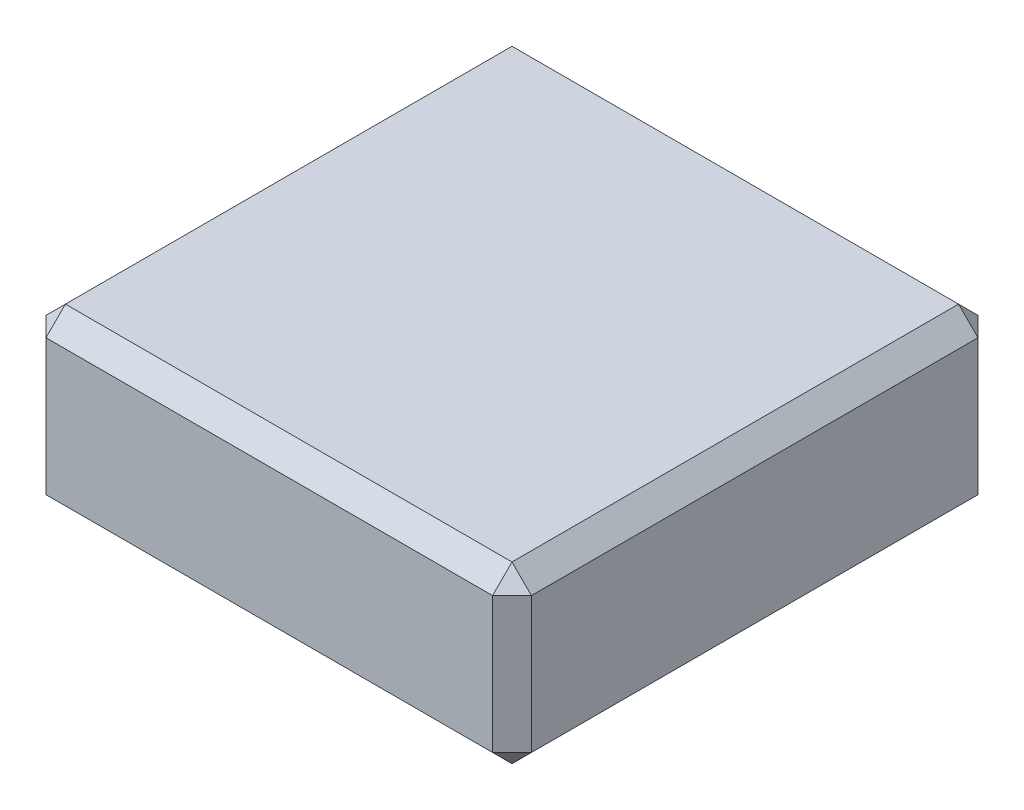
ISO-10303-21;
HEADER;
FILE_DESCRIPTION(('STEP AP214'),'2;1');
FILE_NAME('part.step','',(''),(''),'','','');
FILE_SCHEMA(('AUTOMOTIVE_DESIGN { 1 0 10303 214 1 1 1 1 }'));
ENDSEC;
DATA;
#1=APPLICATION_CONTEXT('core data for automotive mechanical design processes');
#2=APPLICATION_PROTOCOL_DEFINITION('international standard','automotive_design',2000,#1);
#3=PRODUCT_CONTEXT('',#1,'mechanical');
#4=PRODUCT('Part','Part','',(#3));
#5=PRODUCT_RELATED_PRODUCT_CATEGORY('part','',(#4));
#6=PRODUCT_DEFINITION_FORMATION('','',#4);
#7=PRODUCT_DEFINITION_CONTEXT('part definition',#1,'design');
#8=PRODUCT_DEFINITION('design','',#6,#7);
#9=PRODUCT_DEFINITION_SHAPE('','',#8);
#10=(LENGTH_UNIT() NAMED_UNIT(*) SI_UNIT(.MILLI.,.METRE.));
#11=(NAMED_UNIT(*) PLANE_ANGLE_UNIT() SI_UNIT($,.RADIAN.));
#12=(NAMED_UNIT(*) SI_UNIT($,.STERADIAN.) SOLID_ANGLE_UNIT());
#13=UNCERTAINTY_MEASURE_WITH_UNIT(LENGTH_MEASURE(1.E-05),#10,'distance_accuracy_value','');
#14=(GEOMETRIC_REPRESENTATION_CONTEXT(3) GLOBAL_UNCERTAINTY_ASSIGNED_CONTEXT((#13)) GLOBAL_UNIT_ASSIGNED_CONTEXT((#10,
#11,#12)) REPRESENTATION_CONTEXT('',''));
#15=CARTESIAN_POINT('',(0.,0.,0.));
#16=DIRECTION('',(0.,0.,1.));
#17=DIRECTION('',(1.,0.,0.));
#18=AXIS2_PLACEMENT_3D('',#15,#16,#17);
#19=CARTESIAN_POINT('',(0.,18.,0.));
#20=DIRECTION('',(1.,0.,0.));
#21=DIRECTION('',(0.,0.,-1.));
#22=AXIS2_PLACEMENT_3D('',#19,#20,#21);
#23=PLANE('',#22);
#24=DIRECTION('',(0.,0.,-1.));
#25=VECTOR('',#24,1.);
#26=CARTESIAN_POINT('',(0.,16.,0.));
#27=LINE('',#26,#25);
#28=CARTESIAN_POINT('',(0.,16.,48.));
#29=VERTEX_POINT('',#28);
#30=CARTESIAN_POINT('',(0.,16.,2.00000000000001));
#31=VERTEX_POINT('',#30);
#32=EDGE_CURVE('E196',#29,#31,#27,.T.);
#33=ORIENTED_EDGE('',*,*,#32,.T.);
#34=DIRECTION('',(0.,-1.,0.));
#35=VECTOR('',#34,1.);
#36=CARTESIAN_POINT('',(0.,18.,2.00000000000001));
#37=LINE('',#36,#35);
#38=CARTESIAN_POINT('',(0.,2.00000000000001,2.00000000000001));
#39=VERTEX_POINT('',#38);
#40=EDGE_CURVE('E198',#31,#39,#37,.T.);
#41=ORIENTED_EDGE('',*,*,#40,.T.);
#42=DIRECTION('',(0.,0.,1.));
#43=VECTOR('',#42,1.);
#44=CARTESIAN_POINT('',(0.,2.00000000000001,0.));
#45=LINE('',#44,#43);
#46=CARTESIAN_POINT('',(0.,2.00000000000001,48.));
#47=VERTEX_POINT('',#46);
#48=EDGE_CURVE('E192',#39,#47,#45,.T.);
#49=ORIENTED_EDGE('',*,*,#48,.T.);
#50=DIRECTION('',(0.,1.,0.));
#51=VECTOR('',#50,1.);
#52=CARTESIAN_POINT('',(0.,18.,48.));
#53=LINE('',#52,#51);
#54=EDGE_CURVE('E194',#47,#29,#53,.T.);
#55=ORIENTED_EDGE('',*,*,#54,.T.);
#56=EDGE_LOOP('',(#33,#41,#49,#55));
#57=FACE_BOUND('',#56,.T.);
#58=ADVANCED_FACE('F36',(#57),#23,.F.);
#59=CARTESIAN_POINT('',(0.,18.,50.));
#60=DIRECTION('',(0.,0.,-1.));
#61=DIRECTION('',(-1.,0.,0.));
#62=AXIS2_PLACEMENT_3D('',#59,#60,#61);
#63=PLANE('',#62);
#64=DIRECTION('',(0.,1.,0.));
#65=VECTOR('',#64,1.);
#66=CARTESIAN_POINT('',(48.,18.,50.));
#67=LINE('',#66,#65);
#68=CARTESIAN_POINT('',(48.,2.00000000000001,50.));
#69=VERTEX_POINT('',#68);
#70=CARTESIAN_POINT('',(48.,16.,50.));
#71=VERTEX_POINT('',#70);
#72=EDGE_CURVE('E185',#69,#71,#67,.T.);
#73=ORIENTED_EDGE('',*,*,#72,.T.);
#74=DIRECTION('',(-1.,0.,0.));
#75=VECTOR('',#74,1.);
#76=CARTESIAN_POINT('',(0.,16.,50.));
#77=LINE('',#76,#75);
#78=CARTESIAN_POINT('',(2.00000000000001,16.,50.));
#79=VERTEX_POINT('',#78);
#80=EDGE_CURVE('E143',#71,#79,#77,.T.);
#81=ORIENTED_EDGE('',*,*,#80,.T.);
#82=DIRECTION('',(0.,-1.,0.));
#83=VECTOR('',#82,1.);
#84=CARTESIAN_POINT('',(2.00000000000001,18.,50.));
#85=LINE('',#84,#83);
#86=CARTESIAN_POINT('',(2.00000000000001,2.00000000000001,50.));
#87=VERTEX_POINT('',#86);
#88=EDGE_CURVE('E189',#79,#87,#85,.T.);
#89=ORIENTED_EDGE('',*,*,#88,.T.);
#90=DIRECTION('',(1.,0.,0.));
#91=VECTOR('',#90,1.);
#92=CARTESIAN_POINT('',(0.,2.00000000000001,50.));
#93=LINE('',#92,#91);
#94=EDGE_CURVE('E187',#87,#69,#93,.T.);
#95=ORIENTED_EDGE('',*,*,#94,.T.);
#96=EDGE_LOOP('',(#73,#81,#89,#95));
#97=FACE_BOUND('',#96,.T.);
#98=ADVANCED_FACE('F298',(#97),#63,.F.);
#99=CARTESIAN_POINT('',(50.,18.,0.));
#100=DIRECTION('',(-1.,0.,0.));
#101=DIRECTION('',(0.,0.,1.));
#102=AXIS2_PLACEMENT_3D('',#99,#100,#101);
#103=PLANE('',#102);
#104=DIRECTION('',(0.,0.,1.));
#105=VECTOR('',#104,1.);
#106=CARTESIAN_POINT('',(50.,16.,50.));
#107=LINE('',#106,#105);
#108=CARTESIAN_POINT('',(50.,16.,2.00000000000001));
#109=VERTEX_POINT('',#108);
#110=CARTESIAN_POINT('',(50.,16.,48.));
#111=VERTEX_POINT('',#110);
#112=EDGE_CURVE('E45',#109,#111,#107,.T.);
#113=ORIENTED_EDGE('',*,*,#112,.T.);
#114=DIRECTION('',(0.,-1.,0.));
#115=VECTOR('',#114,1.);
#116=CARTESIAN_POINT('',(50.,18.,48.));
#117=LINE('',#116,#115);
#118=CARTESIAN_POINT('',(50.,2.00000000000001,48.));
#119=VERTEX_POINT('',#118);
#120=EDGE_CURVE('E11',#111,#119,#117,.T.);
#121=ORIENTED_EDGE('',*,*,#120,.T.);
#122=DIRECTION('',(0.,0.,-1.));
#123=VECTOR('',#122,1.);
#124=CARTESIAN_POINT('',(50.,2.00000000000001,0.));
#125=LINE('',#124,#123);
#126=CARTESIAN_POINT('',(50.,2.00000000000001,2.00000000000001));
#127=VERTEX_POINT('',#126);
#128=EDGE_CURVE('E201',#119,#127,#125,.T.);
#129=ORIENTED_EDGE('',*,*,#128,.T.);
#130=DIRECTION('',(0.,1.,0.));
#131=VECTOR('',#130,1.);
#132=CARTESIAN_POINT('',(50.,18.,2.00000000000001));
#133=LINE('',#132,#131);
#134=EDGE_CURVE('E56',#127,#109,#133,.T.);
#135=ORIENTED_EDGE('',*,*,#134,.T.);
#136=EDGE_LOOP('',(#113,#121,#129,#135));
#137=FACE_BOUND('',#136,.T.);
#138=ADVANCED_FACE('F300',(#137),#103,.F.);
#139=CARTESIAN_POINT('',(0.,18.,0.));
#140=DIRECTION('',(0.,0.,1.));
#141=DIRECTION('',(1.,0.,0.));
#142=AXIS2_PLACEMENT_3D('',#139,#140,#141);
#143=PLANE('',#142);
#144=DIRECTION('',(-1.,0.,0.));
#145=VECTOR('',#144,1.);
#146=CARTESIAN_POINT('',(0.,2.00000000000001,0.));
#147=LINE('',#146,#145);
#148=CARTESIAN_POINT('',(48.,2.00000000000001,0.));
#149=VERTEX_POINT('',#148);
#150=CARTESIAN_POINT('',(2.00000000000002,2.00000000000001,0.));
#151=VERTEX_POINT('',#150);
#152=EDGE_CURVE('E169',#149,#151,#147,.T.);
#153=ORIENTED_EDGE('',*,*,#152,.T.);
#154=DIRECTION('',(0.,1.,0.));
#155=VECTOR('',#154,1.);
#156=CARTESIAN_POINT('',(2.00000000000002,18.,0.));
#157=LINE('',#156,#155);
#158=CARTESIAN_POINT('',(2.00000000000002,16.,0.));
#159=VERTEX_POINT('',#158);
#160=EDGE_CURVE('E174',#151,#159,#157,.T.);
#161=ORIENTED_EDGE('',*,*,#160,.T.);
#162=DIRECTION('',(1.,0.,0.));
#163=VECTOR('',#162,1.);
#164=CARTESIAN_POINT('',(50.,16.,0.));
#165=LINE('',#164,#163);
#166=CARTESIAN_POINT('',(48.,16.,0.));
#167=VERTEX_POINT('',#166);
#168=EDGE_CURVE('E171',#159,#167,#165,.T.);
#169=ORIENTED_EDGE('',*,*,#168,.T.);
#170=DIRECTION('',(0.,-1.,0.));
#171=VECTOR('',#170,1.);
#172=CARTESIAN_POINT('',(48.,18.,0.));
#173=LINE('',#172,#171);
#174=EDGE_CURVE('E167',#167,#149,#173,.T.);
#175=ORIENTED_EDGE('',*,*,#174,.T.);
#176=EDGE_LOOP('',(#153,#161,#169,#175));
#177=FACE_BOUND('',#176,.T.);
#178=ADVANCED_FACE('F306',(#177),#143,.F.);
#179=CARTESIAN_POINT('',(0.,18.,50.));
#180=DIRECTION('',(0.,1.,0.));
#181=DIRECTION('',(0.,0.,1.));
#182=AXIS2_PLACEMENT_3D('',#179,#180,#181);
#183=PLANE('',#182);
#184=DIRECTION('',(-1.,0.,0.));
#185=VECTOR('',#184,1.);
#186=CARTESIAN_POINT('',(0.,18.,2.00000000000001));
#187=LINE('',#186,#185);
#188=CARTESIAN_POINT('',(48.,18.,2.00000000000001));
#189=VERTEX_POINT('',#188);
#190=CARTESIAN_POINT('',(2.00000000000001,18.,2.00000000000001));
#191=VERTEX_POINT('',#190);
#192=EDGE_CURVE('E135',#189,#191,#187,.T.);
#193=ORIENTED_EDGE('',*,*,#192,.T.);
#194=DIRECTION('',(0.,0.,1.));
#195=VECTOR('',#194,1.);
#196=CARTESIAN_POINT('',(2.00000000000001,18.,50.));
#197=LINE('',#196,#195);
#198=CARTESIAN_POINT('',(2.00000000000001,18.,48.));
#199=VERTEX_POINT('',#198);
#200=EDGE_CURVE('E131',#191,#199,#197,.T.);
#201=ORIENTED_EDGE('',*,*,#200,.T.);
#202=DIRECTION('',(1.,0.,0.));
#203=VECTOR('',#202,1.);
#204=CARTESIAN_POINT('',(50.,18.,48.));
#205=LINE('',#204,#203);
#206=CARTESIAN_POINT('',(48.,18.,48.));
#207=VERTEX_POINT('',#206);
#208=EDGE_CURVE('E123',#199,#207,#205,.T.);
#209=ORIENTED_EDGE('',*,*,#208,.T.);
#210=DIRECTION('',(0.,0.,-1.));
#211=VECTOR('',#210,1.);
#212=CARTESIAN_POINT('',(48.,18.,0.));
#213=LINE('',#212,#211);
#214=EDGE_CURVE('E128',#207,#189,#213,.T.);
#215=ORIENTED_EDGE('',*,*,#214,.T.);
#216=EDGE_LOOP('',(#193,#201,#209,#215));
#217=FACE_BOUND('',#216,.T.);
#218=ADVANCED_FACE('F126',(#217),#183,.T.);
#219=CARTESIAN_POINT('',(0.,0.,50.));
#220=DIRECTION('',(0.,1.,0.));
#221=DIRECTION('',(0.,0.,1.));
#222=AXIS2_PLACEMENT_3D('',#219,#220,#221);
#223=PLANE('',#222);
#224=DIRECTION('',(0.,0.,-1.));
#225=VECTOR('',#224,1.);
#226=CARTESIAN_POINT('',(2.00000000000002,0.,50.));
#227=LINE('',#226,#225);
#228=CARTESIAN_POINT('',(2.00000000000002,0.,48.));
#229=VERTEX_POINT('',#228);
#230=CARTESIAN_POINT('',(2.00000000000002,0.,2.00000000000002));
#231=VERTEX_POINT('',#230);
#232=EDGE_CURVE('E180',#229,#231,#227,.T.);
#233=ORIENTED_EDGE('',*,*,#232,.T.);
#234=DIRECTION('',(1.,0.,0.));
#235=VECTOR('',#234,1.);
#236=CARTESIAN_POINT('',(0.,0.,2.00000000000002));
#237=LINE('',#236,#235);
#238=CARTESIAN_POINT('',(48.,0.,2.00000000000002));
#239=VERTEX_POINT('',#238);
#240=EDGE_CURVE('E182',#231,#239,#237,.T.);
#241=ORIENTED_EDGE('',*,*,#240,.T.);
#242=DIRECTION('',(0.,0.,1.));
#243=VECTOR('',#242,1.);
#244=CARTESIAN_POINT('',(48.,0.,50.));
#245=LINE('',#244,#243);
#246=CARTESIAN_POINT('',(48.,0.,48.));
#247=VERTEX_POINT('',#246);
#248=EDGE_CURVE('E176',#239,#247,#245,.T.);
#249=ORIENTED_EDGE('',*,*,#248,.T.);
#250=DIRECTION('',(-1.,0.,0.));
#251=VECTOR('',#250,1.);
#252=CARTESIAN_POINT('',(0.,0.,48.));
#253=LINE('',#252,#251);
#254=EDGE_CURVE('E178',#247,#229,#253,.T.);
#255=ORIENTED_EDGE('',*,*,#254,.T.);
#256=EDGE_LOOP('',(#233,#241,#249,#255));
#257=FACE_BOUND('',#256,.T.);
#258=ADVANCED_FACE('F276',(#257),#223,.F.);
#259=CARTESIAN_POINT('',(0.,2.00000000000001,50.));
#260=DIRECTION('',(0.,0.707106781186549,-0.707106781186546));
#261=DIRECTION('',(0.,0.707106781186546,0.707106781186549));
#262=AXIS2_PLACEMENT_3D('',#259,#260,#261);
#263=PLANE('',#262);
#264=DIRECTION('',(0.,0.707106781186546,0.707106781186549));
#265=VECTOR('',#264,1.);
#266=CARTESIAN_POINT('',(48.,2.00000000000001,50.));
#267=LINE('',#266,#265);
#268=EDGE_CURVE('E40',#69,#247,#267,.F.);
#269=ORIENTED_EDGE('',*,*,#268,.F.);
#270=ORIENTED_EDGE('',*,*,#94,.F.);
#271=DIRECTION('',(0.,-0.707106781186546,-0.707106781186549));
#272=VECTOR('',#271,1.);
#273=CARTESIAN_POINT('',(2.00000000000001,2.00000000000001,50.));
#274=LINE('',#273,#272);
#275=EDGE_CURVE('E163',#229,#87,#274,.F.);
#276=ORIENTED_EDGE('',*,*,#275,.F.);
#277=ORIENTED_EDGE('',*,*,#254,.F.);
#278=EDGE_LOOP('',(#269,#270,#276,#277));
#279=FACE_BOUND('',#278,.T.);
#280=ADVANCED_FACE('F38',(#279),#263,.F.);
#281=CARTESIAN_POINT('',(48.,2.00000000000001,50.));
#282=DIRECTION('',(0.577350269189624,-0.577350269189628,0.577350269189626));
#283=DIRECTION('',(0.,-0.707106781186546,-0.707106781186549));
#284=AXIS2_PLACEMENT_3D('',#281,#282,#283);
#285=PLANE('',#284);
#286=DIRECTION('',(0.707106781186549,0.,-0.707106781186546));
#287=VECTOR('',#286,1.);
#288=CARTESIAN_POINT('',(48.,2.00000000000001,50.));
#289=LINE('',#288,#287);
#290=EDGE_CURVE('E246',#69,#119,#289,.T.);
#291=ORIENTED_EDGE('',*,*,#290,.F.);
#292=ORIENTED_EDGE('',*,*,#268,.T.);
#293=DIRECTION('',(-0.707106781186549,-0.707106781186546,0.));
#294=VECTOR('',#293,1.);
#295=CARTESIAN_POINT('',(49.,1.,48.));
#296=LINE('',#295,#294);
#297=EDGE_CURVE('E249',#119,#247,#296,.T.);
#298=ORIENTED_EDGE('',*,*,#297,.F.);
#299=EDGE_LOOP('',(#291,#292,#298));
#300=FACE_BOUND('',#299,.T.);
#301=ADVANCED_FACE('F293',(#300),#285,.T.);
#302=CARTESIAN_POINT('',(2.00000000000001,2.00000000000001,50.));
#303=DIRECTION('',(-0.577350269189626,-0.577350269189628,0.577350269189624));
#304=DIRECTION('',(0.707106781186549,-0.707106781186546,0.));
#305=AXIS2_PLACEMENT_3D('',#302,#303,#304);
#306=PLANE('',#305);
#307=DIRECTION('',(-0.707106781186549,0.707106781186546,0.));
#308=VECTOR('',#307,1.);
#309=CARTESIAN_POINT('',(1.00000000000001,1.,48.));
#310=LINE('',#309,#308);
#311=EDGE_CURVE('E240',#229,#47,#310,.T.);
#312=ORIENTED_EDGE('',*,*,#311,.F.);
#313=ORIENTED_EDGE('',*,*,#275,.T.);
#314=DIRECTION('',(0.707106781186546,0.,0.707106781186549));
#315=VECTOR('',#314,1.);
#316=CARTESIAN_POINT('',(2.00000000000001,2.00000000000001,50.));
#317=LINE('',#316,#315);
#318=EDGE_CURVE('E243',#47,#87,#317,.T.);
#319=ORIENTED_EDGE('',*,*,#318,.F.);
#320=EDGE_LOOP('',(#312,#313,#319));
#321=FACE_BOUND('',#320,.T.);
#322=ADVANCED_FACE('F256',(#321),#306,.T.);
#323=CARTESIAN_POINT('',(50.,2.00000000000001,0.));
#324=DIRECTION('',(-0.707106781186546,0.707106781186549,0.));
#325=DIRECTION('',(-0.707106781186549,-0.707106781186546,0.));
#326=AXIS2_PLACEMENT_3D('',#323,#324,#325);
#327=PLANE('',#326);
#328=ORIENTED_EDGE('',*,*,#297,.T.);
#329=ORIENTED_EDGE('',*,*,#248,.F.);
#330=DIRECTION('',(0.707106781186549,0.707106781186546,0.));
#331=VECTOR('',#330,1.);
#332=CARTESIAN_POINT('',(48.,0.,2.00000000000002));
#333=LINE('',#332,#331);
#334=EDGE_CURVE('E235',#127,#239,#333,.F.);
#335=ORIENTED_EDGE('',*,*,#334,.F.);
#336=ORIENTED_EDGE('',*,*,#128,.F.);
#337=EDGE_LOOP('',(#328,#329,#335,#336));
#338=FACE_BOUND('',#337,.T.);
#339=ADVANCED_FACE('F288',(#338),#327,.F.);
#340=CARTESIAN_POINT('',(50.,18.,48.));
#341=DIRECTION('',(-0.707106781186546,0.,-0.707106781186549));
#342=DIRECTION('',(-0.707106781186549,0.,0.707106781186546));
#343=AXIS2_PLACEMENT_3D('',#340,#341,#342);
#344=PLANE('',#343);
#345=ORIENTED_EDGE('',*,*,#290,.T.);
#346=ORIENTED_EDGE('',*,*,#120,.F.);
#347=DIRECTION('',(-0.707106781186549,0.,0.707106781186546));
#348=VECTOR('',#347,1.);
#349=CARTESIAN_POINT('',(49.,16.,49.));
#350=LINE('',#349,#348);
#351=EDGE_CURVE('E147',#71,#111,#350,.F.);
#352=ORIENTED_EDGE('',*,*,#351,.F.);
#353=ORIENTED_EDGE('',*,*,#72,.F.);
#354=EDGE_LOOP('',(#345,#346,#352,#353));
#355=FACE_BOUND('',#354,.T.);
#356=ADVANCED_FACE('F296',(#355),#344,.F.);
#357=CARTESIAN_POINT('',(0.,18.,48.));
#358=DIRECTION('',(0.,0.707106781186546,0.707106781186549));
#359=DIRECTION('',(0.,-0.707106781186549,0.707106781186546));
#360=AXIS2_PLACEMENT_3D('',#357,#358,#359);
#361=PLANE('',#360);
#362=DIRECTION('',(0.,0.707106781186549,-0.707106781186546));
#363=VECTOR('',#362,1.);
#364=CARTESIAN_POINT('',(2.00000000000001,16.,50.));
#365=LINE('',#364,#363);
#366=EDGE_CURVE('E148',#79,#199,#365,.T.);
#367=ORIENTED_EDGE('',*,*,#366,.F.);
#368=ORIENTED_EDGE('',*,*,#80,.F.);
#369=DIRECTION('',(0.,-0.707106781186549,0.707106781186546));
#370=VECTOR('',#369,1.);
#371=CARTESIAN_POINT('',(48.,18.,48.));
#372=LINE('',#371,#370);
#373=EDGE_CURVE('E139',#207,#71,#372,.T.);
#374=ORIENTED_EDGE('',*,*,#373,.F.);
#375=ORIENTED_EDGE('',*,*,#208,.F.);
#376=EDGE_LOOP('',(#367,#368,#374,#375));
#377=FACE_BOUND('',#376,.T.);
#378=ADVANCED_FACE('F141',(#377),#361,.T.);
#379=CARTESIAN_POINT('',(2.00000000000001,18.,50.));
#380=DIRECTION('',(0.707106781186549,0.,-0.707106781186546));
#381=DIRECTION('',(-0.707106781186546,0.,-0.707106781186549));
#382=AXIS2_PLACEMENT_3D('',#379,#380,#381);
#383=PLANE('',#382);
#384=ORIENTED_EDGE('',*,*,#318,.T.);
#385=ORIENTED_EDGE('',*,*,#88,.F.);
#386=DIRECTION('',(-0.707106781186546,0.,-0.707106781186549));
#387=VECTOR('',#386,1.);
#388=CARTESIAN_POINT('',(2.00000000000001,16.,50.));
#389=LINE('',#388,#387);
#390=EDGE_CURVE('E231',#29,#79,#389,.F.);
#391=ORIENTED_EDGE('',*,*,#390,.F.);
#392=ORIENTED_EDGE('',*,*,#54,.F.);
#393=EDGE_LOOP('',(#384,#385,#391,#392));
#394=FACE_BOUND('',#393,.T.);
#395=ADVANCED_FACE('F264',(#394),#383,.F.);
#396=CARTESIAN_POINT('',(0.,2.00000000000001,0.));
#397=DIRECTION('',(0.707106781186546,0.707106781186549,0.));
#398=DIRECTION('',(-0.707106781186549,0.707106781186546,0.));
#399=AXIS2_PLACEMENT_3D('',#396,#397,#398);
#400=PLANE('',#399);
#401=ORIENTED_EDGE('',*,*,#311,.T.);
#402=ORIENTED_EDGE('',*,*,#48,.F.);
#403=DIRECTION('',(0.707106781186549,-0.707106781186546,0.));
#404=VECTOR('',#403,1.);
#405=CARTESIAN_POINT('',(1.00000000000001,1.,2.00000000000001));
#406=LINE('',#405,#404);
#407=EDGE_CURVE('E228',#231,#39,#406,.F.);
#408=ORIENTED_EDGE('',*,*,#407,.F.);
#409=ORIENTED_EDGE('',*,*,#232,.F.);
#410=EDGE_LOOP('',(#401,#402,#408,#409));
#411=FACE_BOUND('',#410,.T.);
#412=ADVANCED_FACE('F273',(#411),#400,.F.);
#413=CARTESIAN_POINT('',(0.,2.00000000000001,0.));
#414=DIRECTION('',(0.,0.707106781186549,0.707106781186546));
#415=DIRECTION('',(0.,-0.707106781186546,0.707106781186549));
#416=AXIS2_PLACEMENT_3D('',#413,#414,#415);
#417=PLANE('',#416);
#418=DIRECTION('',(0.,-0.707106781186546,0.707106781186549));
#419=VECTOR('',#418,1.);
#420=CARTESIAN_POINT('',(48.,0.,2.00000000000002));
#421=LINE('',#420,#419);
#422=EDGE_CURVE('E237',#239,#149,#421,.F.);
#423=ORIENTED_EDGE('',*,*,#422,.F.);
#424=ORIENTED_EDGE('',*,*,#240,.F.);
#425=DIRECTION('',(0.,0.707106781186546,-0.707106781186549));
#426=VECTOR('',#425,1.);
#427=CARTESIAN_POINT('',(2.00000000000002,2.00000000000001,0.));
#428=LINE('',#427,#426);
#429=EDGE_CURVE('E225',#151,#231,#428,.F.);
#430=ORIENTED_EDGE('',*,*,#429,.F.);
#431=ORIENTED_EDGE('',*,*,#152,.F.);
#432=EDGE_LOOP('',(#423,#424,#430,#431));
#433=FACE_BOUND('',#432,.T.);
#434=ADVANCED_FACE('F280',(#433),#417,.F.);
#435=CARTESIAN_POINT('',(48.,0.,2.00000000000002));
#436=DIRECTION('',(0.577350269189624,-0.577350269189628,-0.577350269189626));
#437=DIRECTION('',(0.,0.707106781186546,-0.707106781186549));
#438=AXIS2_PLACEMENT_3D('',#435,#436,#437);
#439=PLANE('',#438);
#440=ORIENTED_EDGE('',*,*,#334,.T.);
#441=ORIENTED_EDGE('',*,*,#422,.T.);
#442=DIRECTION('',(-0.707106781186549,0.,-0.707106781186546));
#443=VECTOR('',#442,1.);
#444=CARTESIAN_POINT('',(49.,2.00000000000001,1.));
#445=LINE('',#444,#443);
#446=EDGE_CURVE('E154',#127,#149,#445,.T.);
#447=ORIENTED_EDGE('',*,*,#446,.F.);
#448=EDGE_LOOP('',(#440,#441,#447));
#449=FACE_BOUND('',#448,.T.);
#450=ADVANCED_FACE('F347',(#449),#439,.T.);
#451=CARTESIAN_POINT('',(48.,18.,48.));
#452=DIRECTION('',(0.577350269189624,0.577350269189626,0.577350269189628));
#453=DIRECTION('',(0.,-0.707106781186549,0.707106781186546));
#454=AXIS2_PLACEMENT_3D('',#451,#452,#453);
#455=PLANE('',#454);
#456=ORIENTED_EDGE('',*,*,#373,.T.);
#457=ORIENTED_EDGE('',*,*,#351,.T.);
#458=DIRECTION('',(-0.707106781186549,0.707106781186546,0.));
#459=VECTOR('',#458,1.);
#460=CARTESIAN_POINT('',(48.,18.,48.));
#461=LINE('',#460,#459);
#462=EDGE_CURVE('E151',#207,#111,#461,.F.);
#463=ORIENTED_EDGE('',*,*,#462,.F.);
#464=EDGE_LOOP('',(#456,#457,#463));
#465=FACE_BOUND('',#464,.T.);
#466=ADVANCED_FACE('F152',(#465),#455,.T.);
#467=CARTESIAN_POINT('',(2.00000000000001,16.,50.));
#468=DIRECTION('',(-0.577350269189628,0.577350269189624,0.577350269189626));
#469=DIRECTION('',(0.707106781186546,0.,0.707106781186549));
#470=AXIS2_PLACEMENT_3D('',#467,#468,#469);
#471=PLANE('',#470);
#472=ORIENTED_EDGE('',*,*,#390,.T.);
#473=ORIENTED_EDGE('',*,*,#366,.T.);
#474=DIRECTION('',(-0.707106781186546,-0.707106781186549,0.));
#475=VECTOR('',#474,1.);
#476=CARTESIAN_POINT('',(1.00000000000001,17.,48.));
#477=LINE('',#476,#475);
#478=EDGE_CURVE('E155',#29,#199,#477,.F.);
#479=ORIENTED_EDGE('',*,*,#478,.F.);
#480=EDGE_LOOP('',(#472,#473,#479));
#481=FACE_BOUND('',#480,.T.);
#482=ADVANCED_FACE('F340',(#481),#471,.T.);
#483=CARTESIAN_POINT('',(2.00000000000002,2.00000000000001,0.));
#484=DIRECTION('',(-0.577350269189624,-0.577350269189628,-0.577350269189626));
#485=DIRECTION('',(0.,0.707106781186546,-0.707106781186549));
#486=AXIS2_PLACEMENT_3D('',#483,#484,#485);
#487=PLANE('',#486);
#488=ORIENTED_EDGE('',*,*,#429,.T.);
#489=ORIENTED_EDGE('',*,*,#407,.T.);
#490=DIRECTION('',(-0.707106781186549,0.,0.707106781186546));
#491=VECTOR('',#490,1.);
#492=CARTESIAN_POINT('',(2.00000000000002,2.00000000000001,0.));
#493=LINE('',#492,#491);
#494=EDGE_CURVE('E219',#151,#39,#493,.T.);
#495=ORIENTED_EDGE('',*,*,#494,.F.);
#496=EDGE_LOOP('',(#488,#489,#495));
#497=FACE_BOUND('',#496,.T.);
#498=ADVANCED_FACE('F336',(#497),#487,.T.);
#499=CARTESIAN_POINT('',(48.,18.,0.));
#500=DIRECTION('',(-0.707106781186546,0.,0.707106781186549));
#501=DIRECTION('',(0.707106781186549,0.,0.707106781186546));
#502=AXIS2_PLACEMENT_3D('',#499,#500,#501);
#503=PLANE('',#502);
#504=ORIENTED_EDGE('',*,*,#446,.T.);
#505=ORIENTED_EDGE('',*,*,#174,.F.);
#506=DIRECTION('',(0.707106781186549,0.,0.707106781186546));
#507=VECTOR('',#506,1.);
#508=CARTESIAN_POINT('',(48.,16.,0.));
#509=LINE('',#508,#507);
#510=EDGE_CURVE('E216',#109,#167,#509,.F.);
#511=ORIENTED_EDGE('',*,*,#510,.F.);
#512=ORIENTED_EDGE('',*,*,#134,.F.);
#513=EDGE_LOOP('',(#504,#505,#511,#512));
#514=FACE_BOUND('',#513,.T.);
#515=ADVANCED_FACE('F333',(#514),#503,.F.);
#516=CARTESIAN_POINT('',(48.,18.,50.));
#517=DIRECTION('',(0.707106781186546,0.707106781186549,0.));
#518=DIRECTION('',(-0.707106781186549,0.707106781186546,0.));
#519=AXIS2_PLACEMENT_3D('',#516,#517,#518);
#520=PLANE('',#519);
#521=ORIENTED_EDGE('',*,*,#462,.T.);
#522=ORIENTED_EDGE('',*,*,#112,.F.);
#523=DIRECTION('',(0.707106781186549,-0.707106781186546,0.));
#524=VECTOR('',#523,1.);
#525=CARTESIAN_POINT('',(49.,17.,2.00000000000001));
#526=LINE('',#525,#524);
#527=EDGE_CURVE('E159',#189,#109,#526,.T.);
#528=ORIENTED_EDGE('',*,*,#527,.F.);
#529=ORIENTED_EDGE('',*,*,#214,.F.);
#530=EDGE_LOOP('',(#521,#522,#528,#529));
#531=FACE_BOUND('',#530,.T.);
#532=ADVANCED_FACE('F157',(#531),#520,.T.);
#533=CARTESIAN_POINT('',(2.00000000000001,18.,50.));
#534=DIRECTION('',(-0.707106781186549,0.707106781186546,0.));
#535=DIRECTION('',(-0.707106781186546,-0.707106781186549,0.));
#536=AXIS2_PLACEMENT_3D('',#533,#534,#535);
#537=PLANE('',#536);
#538=ORIENTED_EDGE('',*,*,#478,.T.);
#539=ORIENTED_EDGE('',*,*,#200,.F.);
#540=DIRECTION('',(0.707106781186546,0.707106781186549,0.));
#541=VECTOR('',#540,1.);
#542=CARTESIAN_POINT('',(2.00000000000001,18.,2.00000000000001));
#543=LINE('',#542,#541);
#544=EDGE_CURVE('E212',#31,#191,#543,.T.);
#545=ORIENTED_EDGE('',*,*,#544,.F.);
#546=ORIENTED_EDGE('',*,*,#32,.F.);
#547=EDGE_LOOP('',(#538,#539,#545,#546));
#548=FACE_BOUND('',#547,.T.);
#549=ADVANCED_FACE('F326',(#548),#537,.T.);
#550=CARTESIAN_POINT('',(0.,18.,2.00000000000001));
#551=DIRECTION('',(0.707106781186546,0.,0.707106781186549));
#552=DIRECTION('',(0.707106781186549,0.,-0.707106781186546));
#553=AXIS2_PLACEMENT_3D('',#550,#551,#552);
#554=PLANE('',#553);
#555=ORIENTED_EDGE('',*,*,#494,.T.);
#556=ORIENTED_EDGE('',*,*,#40,.F.);
#557=DIRECTION('',(0.707106781186549,0.,-0.707106781186546));
#558=VECTOR('',#557,1.);
#559=CARTESIAN_POINT('',(1.00000000000001,16.,1.));
#560=LINE('',#559,#558);
#561=EDGE_CURVE('E209',#159,#31,#560,.F.);
#562=ORIENTED_EDGE('',*,*,#561,.F.);
#563=ORIENTED_EDGE('',*,*,#160,.F.);
#564=EDGE_LOOP('',(#555,#556,#562,#563));
#565=FACE_BOUND('',#564,.T.);
#566=ADVANCED_FACE('F322',(#565),#554,.F.);
#567=CARTESIAN_POINT('',(48.,16.,0.));
#568=DIRECTION('',(0.577350269189624,0.577350269189626,-0.577350269189628));
#569=DIRECTION('',(0.,0.707106781186549,0.707106781186546));
#570=AXIS2_PLACEMENT_3D('',#567,#568,#569);
#571=PLANE('',#570);
#572=ORIENTED_EDGE('',*,*,#527,.T.);
#573=ORIENTED_EDGE('',*,*,#510,.T.);
#574=DIRECTION('',(0.,0.707106781186549,0.707106781186546));
#575=VECTOR('',#574,1.);
#576=CARTESIAN_POINT('',(48.,16.,0.));
#577=LINE('',#576,#575);
#578=EDGE_CURVE('E207',#189,#167,#577,.F.);
#579=ORIENTED_EDGE('',*,*,#578,.F.);
#580=EDGE_LOOP('',(#572,#573,#579));
#581=FACE_BOUND('',#580,.T.);
#582=ADVANCED_FACE('F318',(#581),#571,.T.);
#583=CARTESIAN_POINT('',(2.00000000000001,18.,2.00000000000001));
#584=DIRECTION('',(-0.577350269189626,0.577350269189624,-0.577350269189628));
#585=DIRECTION('',(-0.707106781186549,0.,0.707106781186546));
#586=AXIS2_PLACEMENT_3D('',#583,#584,#585);
#587=PLANE('',#586);
#588=ORIENTED_EDGE('',*,*,#561,.T.);
#589=ORIENTED_EDGE('',*,*,#544,.T.);
#590=DIRECTION('',(0.,-0.707106781186549,-0.707106781186546));
#591=VECTOR('',#590,1.);
#592=CARTESIAN_POINT('',(2.00000000000001,18.,2.00000000000001));
#593=LINE('',#592,#591);
#594=EDGE_CURVE('E205',#159,#191,#593,.F.);
#595=ORIENTED_EDGE('',*,*,#594,.F.);
#596=EDGE_LOOP('',(#588,#589,#595));
#597=FACE_BOUND('',#596,.T.);
#598=ADVANCED_FACE('F314',(#597),#587,.T.);
#599=CARTESIAN_POINT('',(0.,18.,2.00000000000001));
#600=DIRECTION('',(0.,0.707106781186546,-0.707106781186549));
#601=DIRECTION('',(0.,0.707106781186549,0.707106781186546));
#602=AXIS2_PLACEMENT_3D('',#599,#600,#601);
#603=PLANE('',#602);
#604=ORIENTED_EDGE('',*,*,#578,.T.);
#605=ORIENTED_EDGE('',*,*,#168,.F.);
#606=ORIENTED_EDGE('',*,*,#594,.T.);
#607=ORIENTED_EDGE('',*,*,#192,.F.);
#608=EDGE_LOOP('',(#604,#605,#606,#607));
#609=FACE_BOUND('',#608,.T.);
#610=ADVANCED_FACE('F311',(#609),#603,.T.);
#611=CLOSED_SHELL('',(#58,#98,#138,#178,#218,#258,#280,#301,#322,#339,#356,#378,#395,#412,#434,
#450,#466,#482,#498,#515,#532,#549,#566,#582,#598,#610));
#612=MANIFOLD_SOLID_BREP('B2',#611);
#613=ADVANCED_BREP_SHAPE_REPRESENTATION('',(#18,#612),#14);
#614=SHAPE_DEFINITION_REPRESENTATION(#9,#613);
ENDSEC;
END-ISO-10303-21;
